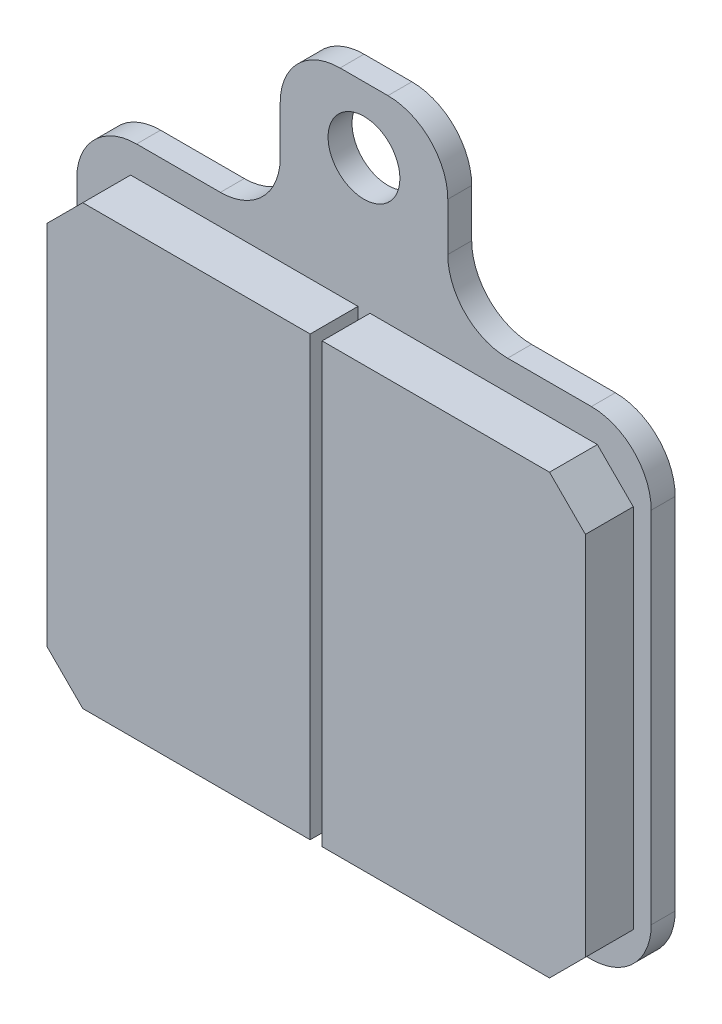
ISO-10303-21;
HEADER;
FILE_DESCRIPTION(('STEP AP214'),'2;1');
FILE_NAME('part.step','',(''),(''),'','','');
FILE_SCHEMA(('AUTOMOTIVE_DESIGN { 1 0 10303 214 1 1 1 1 }'));
ENDSEC;
DATA;
#1=APPLICATION_CONTEXT('core data for automotive mechanical design processes');
#2=APPLICATION_PROTOCOL_DEFINITION('international standard','automotive_design',2000,#1);
#3=PRODUCT_CONTEXT('',#1,'mechanical');
#4=PRODUCT('Part','Part','',(#3));
#5=PRODUCT_RELATED_PRODUCT_CATEGORY('part','',(#4));
#6=PRODUCT_DEFINITION_FORMATION('','',#4);
#7=PRODUCT_DEFINITION_CONTEXT('part definition',#1,'design');
#8=PRODUCT_DEFINITION('design','',#6,#7);
#9=PRODUCT_DEFINITION_SHAPE('','',#8);
#10=(LENGTH_UNIT() NAMED_UNIT(*) SI_UNIT(.MILLI.,.METRE.));
#11=(NAMED_UNIT(*) PLANE_ANGLE_UNIT() SI_UNIT($,.RADIAN.));
#12=(NAMED_UNIT(*) SI_UNIT($,.STERADIAN.) SOLID_ANGLE_UNIT());
#13=UNCERTAINTY_MEASURE_WITH_UNIT(LENGTH_MEASURE(1.E-05),#10,'distance_accuracy_value','');
#14=(GEOMETRIC_REPRESENTATION_CONTEXT(3) GLOBAL_UNCERTAINTY_ASSIGNED_CONTEXT((#13)) GLOBAL_UNIT_ASSIGNED_CONTEXT((#10,
#11,#12)) REPRESENTATION_CONTEXT('',''));
#15=CARTESIAN_POINT('',(0.,0.,0.));
#16=DIRECTION('',(0.,0.,1.));
#17=DIRECTION('',(1.,0.,0.));
#18=AXIS2_PLACEMENT_3D('',#15,#16,#17);
#19=CARTESIAN_POINT('',(2.00000000000001,29.,2.));
#20=DIRECTION('',(0.,0.,1.));
#21=DIRECTION('',(1.,0.,0.));
#22=AXIS2_PLACEMENT_3D('',#19,#20,#21);
#23=PLANE('',#22);
#24=DIRECTION('',(0.,-1.,0.));
#25=VECTOR('',#24,1.);
#26=CARTESIAN_POINT('',(-24.,-20.,2.));
#27=LINE('',#26,#25);
#28=CARTESIAN_POINT('',(-24.,15.,2.));
#29=VERTEX_POINT('',#28);
#30=CARTESIAN_POINT('',(-24.,-15.,2.));
#31=VERTEX_POINT('',#30);
#32=EDGE_CURVE('E300',#29,#31,#27,.T.);
#33=ORIENTED_EDGE('',*,*,#32,.T.);
#34=CARTESIAN_POINT('',(-19.,-15.,2.));
#35=DIRECTION('',(0.,0.,1.));
#36=DIRECTION('',(1.,0.,0.));
#37=AXIS2_PLACEMENT_3D('',#34,#35,#36);
#38=CIRCLE('',#37,5.);
#39=CARTESIAN_POINT('',(-19.,-20.,2.));
#40=VERTEX_POINT('',#39);
#41=EDGE_CURVE('E429',#31,#40,#38,.T.);
#42=ORIENTED_EDGE('',*,*,#41,.T.);
#43=DIRECTION('',(1.,0.,0.));
#44=VECTOR('',#43,1.);
#45=CARTESIAN_POINT('',(24.,-20.,2.));
#46=LINE('',#45,#44);
#47=CARTESIAN_POINT('',(19.,-20.,2.));
#48=VERTEX_POINT('',#47);
#49=EDGE_CURVE('E304',#40,#48,#46,.T.);
#50=ORIENTED_EDGE('',*,*,#49,.T.);
#51=CARTESIAN_POINT('',(19.,-15.,2.));
#52=DIRECTION('',(0.,0.,1.));
#53=DIRECTION('',(1.,0.,0.));
#54=AXIS2_PLACEMENT_3D('',#51,#52,#53);
#55=CIRCLE('',#54,5.);
#56=CARTESIAN_POINT('',(24.,-15.,2.));
#57=VERTEX_POINT('',#56);
#58=EDGE_CURVE('E59',#48,#57,#55,.T.);
#59=ORIENTED_EDGE('',*,*,#58,.T.);
#60=DIRECTION('',(0.,1.,0.));
#61=VECTOR('',#60,1.);
#62=CARTESIAN_POINT('',(24.,-20.,2.));
#63=LINE('',#62,#61);
#64=CARTESIAN_POINT('',(24.,15.,2.));
#65=VERTEX_POINT('',#64);
#66=EDGE_CURVE('E306',#57,#65,#63,.T.);
#67=ORIENTED_EDGE('',*,*,#66,.T.);
#68=CARTESIAN_POINT('',(19.,15.,2.));
#69=DIRECTION('',(0.,0.,1.));
#70=DIRECTION('',(1.,0.,0.));
#71=AXIS2_PLACEMENT_3D('',#68,#69,#70);
#72=CIRCLE('',#71,5.);
#73=CARTESIAN_POINT('',(19.,20.,2.));
#74=VERTEX_POINT('',#73);
#75=EDGE_CURVE('E426',#65,#74,#72,.T.);
#76=ORIENTED_EDGE('',*,*,#75,.T.);
#77=DIRECTION('',(-1.,0.,0.));
#78=VECTOR('',#77,1.);
#79=CARTESIAN_POINT('',(24.,20.,2.));
#80=LINE('',#79,#78);
#81=CARTESIAN_POINT('',(12.,20.,2.));
#82=VERTEX_POINT('',#81);
#83=EDGE_CURVE('E308',#74,#82,#80,.T.);
#84=ORIENTED_EDGE('',*,*,#83,.T.);
#85=CARTESIAN_POINT('',(12.,25.,2.));
#86=DIRECTION('',(0.,0.,1.));
#87=DIRECTION('',(1.,0.,0.));
#88=AXIS2_PLACEMENT_3D('',#85,#86,#87);
#89=CIRCLE('',#88,5.);
#90=CARTESIAN_POINT('',(7.00000000000001,25.,2.));
#91=VERTEX_POINT('',#90);
#92=EDGE_CURVE('E437',#82,#91,#89,.F.);
#93=ORIENTED_EDGE('',*,*,#92,.T.);
#94=DIRECTION('',(0.,1.,0.));
#95=VECTOR('',#94,1.);
#96=CARTESIAN_POINT('',(7.00000000000001,20.,2.));
#97=LINE('',#96,#95);
#98=CARTESIAN_POINT('',(7.00000000000001,29.,2.));
#99=VERTEX_POINT('',#98);
#100=EDGE_CURVE('E311',#91,#99,#97,.T.);
#101=ORIENTED_EDGE('',*,*,#100,.T.);
#102=CARTESIAN_POINT('',(2.00000000000001,29.,2.));
#103=DIRECTION('',(0.,0.,1.));
#104=DIRECTION('',(1.,0.,0.));
#105=AXIS2_PLACEMENT_3D('',#102,#103,#104);
#106=CIRCLE('',#105,5.);
#107=CARTESIAN_POINT('',(1.99999999999997,34.,2.));
#108=VERTEX_POINT('',#107);
#109=EDGE_CURVE('E313',#99,#108,#106,.T.);
#110=ORIENTED_EDGE('',*,*,#109,.T.);
#111=DIRECTION('',(-1.,0.,0.));
#112=VECTOR('',#111,1.);
#113=CARTESIAN_POINT('',(1.99999999999997,34.,2.));
#114=LINE('',#113,#112);
#115=CARTESIAN_POINT('',(-1.99999999999996,34.,2.));
#116=VERTEX_POINT('',#115);
#117=EDGE_CURVE('E315',#108,#116,#114,.T.);
#118=ORIENTED_EDGE('',*,*,#117,.T.);
#119=CARTESIAN_POINT('',(-1.99999999999999,29.,2.));
#120=DIRECTION('',(0.,0.,1.));
#121=DIRECTION('',(1.,0.,0.));
#122=AXIS2_PLACEMENT_3D('',#119,#120,#121);
#123=CIRCLE('',#122,5.);
#124=CARTESIAN_POINT('',(-7.,29.,2.));
#125=VERTEX_POINT('',#124);
#126=EDGE_CURVE('E317',#116,#125,#123,.T.);
#127=ORIENTED_EDGE('',*,*,#126,.T.);
#128=DIRECTION('',(0.,-1.,0.));
#129=VECTOR('',#128,1.);
#130=CARTESIAN_POINT('',(-7.,20.,2.));
#131=LINE('',#130,#129);
#132=CARTESIAN_POINT('',(-6.99999999999999,25.,2.));
#133=VERTEX_POINT('',#132);
#134=EDGE_CURVE('E319',#125,#133,#131,.T.);
#135=ORIENTED_EDGE('',*,*,#134,.T.);
#136=CARTESIAN_POINT('',(-12.,25.,2.));
#137=DIRECTION('',(0.,0.,1.));
#138=DIRECTION('',(1.,0.,0.));
#139=AXIS2_PLACEMENT_3D('',#136,#137,#138);
#140=CIRCLE('',#139,5.);
#141=CARTESIAN_POINT('',(-12.,20.,2.));
#142=VERTEX_POINT('',#141);
#143=EDGE_CURVE('E11',#133,#142,#140,.F.);
#144=ORIENTED_EDGE('',*,*,#143,.T.);
#145=DIRECTION('',(-1.,0.,0.));
#146=VECTOR('',#145,1.);
#147=CARTESIAN_POINT('',(-7.,20.,2.));
#148=LINE('',#147,#146);
#149=CARTESIAN_POINT('',(-19.,20.,2.));
#150=VERTEX_POINT('',#149);
#151=EDGE_CURVE('E297',#142,#150,#148,.T.);
#152=ORIENTED_EDGE('',*,*,#151,.T.);
#153=CARTESIAN_POINT('',(-19.,15.,2.));
#154=DIRECTION('',(0.,0.,1.));
#155=DIRECTION('',(1.,0.,0.));
#156=AXIS2_PLACEMENT_3D('',#153,#154,#155);
#157=CIRCLE('',#156,5.);
#158=EDGE_CURVE('E424',#150,#29,#157,.T.);
#159=ORIENTED_EDGE('',*,*,#158,.T.);
#160=EDGE_LOOP('',(#33,#42,#50,#59,#67,#76,#84,#93,#101,#110,#118,#127,#135,#144,#152,#159));
#161=FACE_BOUND('',#160,.T.);
#162=CARTESIAN_POINT('',(0.,28.5,2.));
#163=DIRECTION('',(0.,0.,1.));
#164=DIRECTION('',(1.,0.,0.));
#165=AXIS2_PLACEMENT_3D('',#162,#163,#164);
#166=CIRCLE('',#165,3.);
#167=CARTESIAN_POINT('',(3.,28.5,2.));
#168=VERTEX_POINT('',#167);
#169=EDGE_CURVE('E291',#168,#168,#166,.T.);
#170=ORIENTED_EDGE('',*,*,#169,.F.);
#171=EDGE_LOOP('',(#170));
#172=FACE_BOUND('',#171,.T.);
#173=DIRECTION('',(0.,-1.,0.));
#174=VECTOR('',#173,1.);
#175=CARTESIAN_POINT('',(-22.5,-17.5,2.));
#176=LINE('',#175,#174);
#177=CARTESIAN_POINT('',(-22.5,14.5,2.));
#178=VERTEX_POINT('',#177);
#179=CARTESIAN_POINT('',(-22.5,-16.1003534196508,2.));
#180=VERTEX_POINT('',#179);
#181=EDGE_CURVE('E279',#178,#180,#176,.T.);
#182=ORIENTED_EDGE('',*,*,#181,.F.);
#183=DIRECTION('',(-0.707106781186549,-0.707106781186546,0.));
#184=VECTOR('',#183,1.);
#185=CARTESIAN_POINT('',(-22.5,14.5,2.));
#186=LINE('',#185,#184);
#187=CARTESIAN_POINT('',(-19.5,17.5,2.));
#188=VERTEX_POINT('',#187);
#189=EDGE_CURVE('E389',#178,#188,#186,.F.);
#190=ORIENTED_EDGE('',*,*,#189,.T.);
#191=DIRECTION('',(-1.,0.,0.));
#192=VECTOR('',#191,1.);
#193=CARTESIAN_POINT('',(-0.5,17.5,2.));
#194=LINE('',#193,#192);
#195=CARTESIAN_POINT('',(-0.5,17.5,2.));
#196=VERTEX_POINT('',#195);
#197=EDGE_CURVE('E245',#196,#188,#194,.T.);
#198=ORIENTED_EDGE('',*,*,#197,.F.);
#199=DIRECTION('',(0.,1.,0.));
#200=VECTOR('',#199,1.);
#201=CARTESIAN_POINT('',(-0.5,-17.5,2.));
#202=LINE('',#201,#200);
#203=CARTESIAN_POINT('',(-0.5,-19.1003534196508,2.));
#204=VERTEX_POINT('',#203);
#205=EDGE_CURVE('E269',#204,#196,#202,.T.);
#206=ORIENTED_EDGE('',*,*,#205,.F.);
#207=DIRECTION('',(1.,0.,0.));
#208=VECTOR('',#207,1.);
#209=CARTESIAN_POINT('',(-22.5,-19.1003534196508,2.));
#210=LINE('',#209,#208);
#211=CARTESIAN_POINT('',(-19.5,-19.1003534196508,2.));
#212=VERTEX_POINT('',#211);
#213=EDGE_CURVE('E282',#212,#204,#210,.T.);
#214=ORIENTED_EDGE('',*,*,#213,.F.);
#215=DIRECTION('',(0.707106781186547,-0.707106781186548,0.));
#216=VECTOR('',#215,1.);
#217=CARTESIAN_POINT('',(-19.5,-19.1003534196508,2.));
#218=LINE('',#217,#216);
#219=EDGE_CURVE('E387',#212,#180,#218,.F.);
#220=ORIENTED_EDGE('',*,*,#219,.T.);
#221=EDGE_LOOP('',(#182,#190,#198,#206,#214,#220));
#222=FACE_BOUND('',#221,.T.);
#223=DIRECTION('',(-1.,0.,0.));
#224=VECTOR('',#223,1.);
#225=CARTESIAN_POINT('',(22.5,17.5,2.));
#226=LINE('',#225,#224);
#227=CARTESIAN_POINT('',(19.5,17.5,2.));
#228=VERTEX_POINT('',#227);
#229=CARTESIAN_POINT('',(0.5,17.5,2.));
#230=VERTEX_POINT('',#229);
#231=EDGE_CURVE('E241',#228,#230,#226,.T.);
#232=ORIENTED_EDGE('',*,*,#231,.F.);
#233=DIRECTION('',(-0.707106781186546,0.707106781186549,0.));
#234=VECTOR('',#233,1.);
#235=CARTESIAN_POINT('',(19.5,17.5,2.));
#236=LINE('',#235,#234);
#237=CARTESIAN_POINT('',(22.5,14.5,2.));
#238=VERTEX_POINT('',#237);
#239=EDGE_CURVE('E385',#228,#238,#236,.F.);
#240=ORIENTED_EDGE('',*,*,#239,.T.);
#241=DIRECTION('',(0.,1.,0.));
#242=VECTOR('',#241,1.);
#243=CARTESIAN_POINT('',(22.5,-17.5,2.));
#244=LINE('',#243,#242);
#245=CARTESIAN_POINT('',(22.5,-16.1003534196508,2.));
#246=VERTEX_POINT('',#245);
#247=EDGE_CURVE('E255',#246,#238,#244,.T.);
#248=ORIENTED_EDGE('',*,*,#247,.F.);
#249=DIRECTION('',(0.707106781186549,0.707106781186546,0.));
#250=VECTOR('',#249,1.);
#251=CARTESIAN_POINT('',(22.5,-16.1003534196508,2.));
#252=LINE('',#251,#250);
#253=CARTESIAN_POINT('',(19.5,-19.1003534196508,2.));
#254=VERTEX_POINT('',#253);
#255=EDGE_CURVE('E383',#246,#254,#252,.F.);
#256=ORIENTED_EDGE('',*,*,#255,.T.);
#257=DIRECTION('',(1.,0.,0.));
#258=VECTOR('',#257,1.);
#259=CARTESIAN_POINT('',(0.499999999999997,-19.1003534196508,2.));
#260=LINE('',#259,#258);
#261=CARTESIAN_POINT('',(0.499999999999997,-19.1003534196508,2.));
#262=VERTEX_POINT('',#261);
#263=EDGE_CURVE('E261',#262,#254,#260,.T.);
#264=ORIENTED_EDGE('',*,*,#263,.F.);
#265=DIRECTION('',(0.,-1.,0.));
#266=VECTOR('',#265,1.);
#267=CARTESIAN_POINT('',(0.5,-17.5,2.));
#268=LINE('',#267,#266);
#269=EDGE_CURVE('E259',#230,#262,#268,.T.);
#270=ORIENTED_EDGE('',*,*,#269,.F.);
#271=EDGE_LOOP('',(#232,#240,#248,#256,#264,#270));
#272=FACE_BOUND('',#271,.T.);
#273=ADVANCED_FACE('F37',(#161,#172,#222,#272),#23,.T.);
#274=CARTESIAN_POINT('',(2.00000000000001,29.,0.));
#275=DIRECTION('',(0.,0.,1.));
#276=DIRECTION('',(1.,0.,0.));
#277=AXIS2_PLACEMENT_3D('',#274,#275,#276);
#278=PLANE('',#277);
#279=DIRECTION('',(1.,0.,0.));
#280=VECTOR('',#279,1.);
#281=CARTESIAN_POINT('',(24.,-20.,0.));
#282=LINE('',#281,#280);
#283=CARTESIAN_POINT('',(-19.,-20.,0.));
#284=VERTEX_POINT('',#283);
#285=CARTESIAN_POINT('',(19.,-20.,0.));
#286=VERTEX_POINT('',#285);
#287=EDGE_CURVE('E328',#284,#286,#282,.T.);
#288=ORIENTED_EDGE('',*,*,#287,.F.);
#289=CARTESIAN_POINT('',(-19.,-15.,0.));
#290=DIRECTION('',(0.,0.,1.));
#291=DIRECTION('',(1.,0.,0.));
#292=AXIS2_PLACEMENT_3D('',#289,#290,#291);
#293=CIRCLE('',#292,5.);
#294=CARTESIAN_POINT('',(-24.,-15.,0.));
#295=VERTEX_POINT('',#294);
#296=EDGE_CURVE('E417',#284,#295,#293,.F.);
#297=ORIENTED_EDGE('',*,*,#296,.T.);
#298=DIRECTION('',(0.,-1.,0.));
#299=VECTOR('',#298,1.);
#300=CARTESIAN_POINT('',(-24.,-20.,0.));
#301=LINE('',#300,#299);
#302=CARTESIAN_POINT('',(-24.,15.,0.));
#303=VERTEX_POINT('',#302);
#304=EDGE_CURVE('E325',#303,#295,#301,.T.);
#305=ORIENTED_EDGE('',*,*,#304,.F.);
#306=CARTESIAN_POINT('',(-19.,15.,0.));
#307=DIRECTION('',(0.,0.,1.));
#308=DIRECTION('',(1.,0.,0.));
#309=AXIS2_PLACEMENT_3D('',#306,#307,#308);
#310=CIRCLE('',#309,5.);
#311=CARTESIAN_POINT('',(-19.,20.,0.));
#312=VERTEX_POINT('',#311);
#313=EDGE_CURVE('E411',#303,#312,#310,.F.);
#314=ORIENTED_EDGE('',*,*,#313,.T.);
#315=DIRECTION('',(-1.,0.,0.));
#316=VECTOR('',#315,1.);
#317=CARTESIAN_POINT('',(-7.,20.,0.));
#318=LINE('',#317,#316);
#319=CARTESIAN_POINT('',(-12.,20.,0.));
#320=VERTEX_POINT('',#319);
#321=EDGE_CURVE('E294',#320,#312,#318,.T.);
#322=ORIENTED_EDGE('',*,*,#321,.F.);
#323=CARTESIAN_POINT('',(-12.,25.,0.));
#324=DIRECTION('',(0.,0.,1.));
#325=DIRECTION('',(1.,0.,0.));
#326=AXIS2_PLACEMENT_3D('',#323,#324,#325);
#327=CIRCLE('',#326,5.);
#328=CARTESIAN_POINT('',(-6.99999999999999,25.,0.));
#329=VERTEX_POINT('',#328);
#330=EDGE_CURVE('E45',#320,#329,#327,.T.);
#331=ORIENTED_EDGE('',*,*,#330,.T.);
#332=DIRECTION('',(0.,-1.,0.));
#333=VECTOR('',#332,1.);
#334=CARTESIAN_POINT('',(-7.,20.,0.));
#335=LINE('',#334,#333);
#336=CARTESIAN_POINT('',(-7.,29.,0.));
#337=VERTEX_POINT('',#336);
#338=EDGE_CURVE('E301',#337,#329,#335,.T.);
#339=ORIENTED_EDGE('',*,*,#338,.F.);
#340=CARTESIAN_POINT('',(-1.99999999999999,29.,0.));
#341=DIRECTION('',(0.,0.,1.));
#342=DIRECTION('',(1.,0.,0.));
#343=AXIS2_PLACEMENT_3D('',#340,#341,#342);
#344=CIRCLE('',#343,5.);
#345=CARTESIAN_POINT('',(-1.99999999999996,34.,0.));
#346=VERTEX_POINT('',#345);
#347=EDGE_CURVE('E342',#346,#337,#344,.T.);
#348=ORIENTED_EDGE('',*,*,#347,.F.);
#349=DIRECTION('',(-1.,0.,0.));
#350=VECTOR('',#349,1.);
#351=CARTESIAN_POINT('',(1.99999999999997,34.,0.));
#352=LINE('',#351,#350);
#353=CARTESIAN_POINT('',(1.99999999999997,34.,0.));
#354=VERTEX_POINT('',#353);
#355=EDGE_CURVE('E340',#354,#346,#352,.T.);
#356=ORIENTED_EDGE('',*,*,#355,.F.);
#357=CARTESIAN_POINT('',(2.00000000000001,29.,0.));
#358=DIRECTION('',(0.,0.,1.));
#359=DIRECTION('',(1.,0.,0.));
#360=AXIS2_PLACEMENT_3D('',#357,#358,#359);
#361=CIRCLE('',#360,5.);
#362=CARTESIAN_POINT('',(7.00000000000001,29.,0.));
#363=VERTEX_POINT('',#362);
#364=EDGE_CURVE('E338',#363,#354,#361,.T.);
#365=ORIENTED_EDGE('',*,*,#364,.F.);
#366=DIRECTION('',(0.,1.,0.));
#367=VECTOR('',#366,1.);
#368=CARTESIAN_POINT('',(7.00000000000001,20.,0.));
#369=LINE('',#368,#367);
#370=CARTESIAN_POINT('',(7.00000000000001,25.,0.));
#371=VERTEX_POINT('',#370);
#372=EDGE_CURVE('E336',#371,#363,#369,.T.);
#373=ORIENTED_EDGE('',*,*,#372,.F.);
#374=CARTESIAN_POINT('',(12.,25.,0.));
#375=DIRECTION('',(0.,0.,1.));
#376=DIRECTION('',(1.,0.,0.));
#377=AXIS2_PLACEMENT_3D('',#374,#375,#376);
#378=CIRCLE('',#377,5.);
#379=CARTESIAN_POINT('',(12.,20.,0.));
#380=VERTEX_POINT('',#379);
#381=EDGE_CURVE('E435',#371,#380,#378,.T.);
#382=ORIENTED_EDGE('',*,*,#381,.T.);
#383=DIRECTION('',(-1.,0.,0.));
#384=VECTOR('',#383,1.);
#385=CARTESIAN_POINT('',(24.,20.,0.));
#386=LINE('',#385,#384);
#387=CARTESIAN_POINT('',(19.,20.,0.));
#388=VERTEX_POINT('',#387);
#389=EDGE_CURVE('E333',#388,#380,#386,.T.);
#390=ORIENTED_EDGE('',*,*,#389,.F.);
#391=CARTESIAN_POINT('',(19.,15.,0.));
#392=DIRECTION('',(0.,0.,1.));
#393=DIRECTION('',(1.,0.,0.));
#394=AXIS2_PLACEMENT_3D('',#391,#392,#393);
#395=CIRCLE('',#394,5.);
#396=CARTESIAN_POINT('',(24.,15.,0.));
#397=VERTEX_POINT('',#396);
#398=EDGE_CURVE('E413',#388,#397,#395,.F.);
#399=ORIENTED_EDGE('',*,*,#398,.T.);
#400=DIRECTION('',(0.,1.,0.));
#401=VECTOR('',#400,1.);
#402=CARTESIAN_POINT('',(24.,-20.,0.));
#403=LINE('',#402,#401);
#404=CARTESIAN_POINT('',(24.,-15.,0.));
#405=VERTEX_POINT('',#404);
#406=EDGE_CURVE('E331',#405,#397,#403,.T.);
#407=ORIENTED_EDGE('',*,*,#406,.F.);
#408=CARTESIAN_POINT('',(19.,-15.,0.));
#409=DIRECTION('',(0.,0.,1.));
#410=DIRECTION('',(1.,0.,0.));
#411=AXIS2_PLACEMENT_3D('',#408,#409,#410);
#412=CIRCLE('',#411,5.);
#413=EDGE_CURVE('E415',#405,#286,#412,.F.);
#414=ORIENTED_EDGE('',*,*,#413,.T.);
#415=EDGE_LOOP('',(#288,#297,#305,#314,#322,#331,#339,#348,#356,#365,#373,#382,#390,#399,#407,#414));
#416=FACE_BOUND('',#415,.T.);
#417=CARTESIAN_POINT('',(0.,28.5,0.));
#418=DIRECTION('',(0.,0.,1.));
#419=DIRECTION('',(1.,0.,0.));
#420=AXIS2_PLACEMENT_3D('',#417,#418,#419);
#421=CIRCLE('',#420,3.);
#422=CARTESIAN_POINT('',(3.,28.5,0.));
#423=VERTEX_POINT('',#422);
#424=EDGE_CURVE('E290',#423,#423,#421,.T.);
#425=ORIENTED_EDGE('',*,*,#424,.T.);
#426=EDGE_LOOP('',(#425));
#427=FACE_BOUND('',#426,.T.);
#428=ADVANCED_FACE('F442',(#416,#427),#278,.F.);
#429=CARTESIAN_POINT('',(-7.,20.,2.));
#430=DIRECTION('',(0.,-1.,0.));
#431=DIRECTION('',(1.,0.,0.));
#432=AXIS2_PLACEMENT_3D('',#429,#430,#431);
#433=PLANE('',#432);
#434=ORIENTED_EDGE('',*,*,#151,.F.);
#435=DIRECTION('',(0.,0.,-1.));
#436=VECTOR('',#435,1.);
#437=CARTESIAN_POINT('',(-12.,20.,0.));
#438=LINE('',#437,#436);
#439=EDGE_CURVE('E401',#142,#320,#438,.T.);
#440=ORIENTED_EDGE('',*,*,#439,.T.);
#441=ORIENTED_EDGE('',*,*,#321,.T.);
#442=DIRECTION('',(0.,0.,-1.));
#443=VECTOR('',#442,1.);
#444=CARTESIAN_POINT('',(-19.,20.,2.));
#445=LINE('',#444,#443);
#446=EDGE_CURVE('E399',#312,#150,#445,.F.);
#447=ORIENTED_EDGE('',*,*,#446,.T.);
#448=EDGE_LOOP('',(#434,#440,#441,#447));
#449=FACE_BOUND('',#448,.T.);
#450=ADVANCED_FACE('F458',(#449),#433,.F.);
#451=CARTESIAN_POINT('',(-24.,-20.,2.));
#452=DIRECTION('',(1.,0.,0.));
#453=DIRECTION('',(0.,0.,-1.));
#454=AXIS2_PLACEMENT_3D('',#451,#452,#453);
#455=PLANE('',#454);
#456=ORIENTED_EDGE('',*,*,#304,.T.);
#457=DIRECTION('',(0.,0.,-1.));
#458=VECTOR('',#457,1.);
#459=CARTESIAN_POINT('',(-24.,-15.,2.));
#460=LINE('',#459,#458);
#461=EDGE_CURVE('E422',#295,#31,#460,.F.);
#462=ORIENTED_EDGE('',*,*,#461,.T.);
#463=ORIENTED_EDGE('',*,*,#32,.F.);
#464=DIRECTION('',(0.,0.,-1.));
#465=VECTOR('',#464,1.);
#466=CARTESIAN_POINT('',(-24.,15.,2.));
#467=LINE('',#466,#465);
#468=EDGE_CURVE('E419',#29,#303,#467,.T.);
#469=ORIENTED_EDGE('',*,*,#468,.T.);
#470=EDGE_LOOP('',(#456,#462,#463,#469));
#471=FACE_BOUND('',#470,.T.);
#472=ADVANCED_FACE('F465',(#471),#455,.F.);
#473=CARTESIAN_POINT('',(24.,-20.,2.));
#474=DIRECTION('',(0.,1.,0.));
#475=DIRECTION('',(-1.,0.,0.));
#476=AXIS2_PLACEMENT_3D('',#473,#474,#475);
#477=PLANE('',#476);
#478=ORIENTED_EDGE('',*,*,#49,.F.);
#479=DIRECTION('',(0.,0.,-1.));
#480=VECTOR('',#479,1.);
#481=CARTESIAN_POINT('',(-19.,-20.,2.));
#482=LINE('',#481,#480);
#483=EDGE_CURVE('E408',#40,#284,#482,.T.);
#484=ORIENTED_EDGE('',*,*,#483,.T.);
#485=ORIENTED_EDGE('',*,*,#287,.T.);
#486=DIRECTION('',(0.,0.,-1.));
#487=VECTOR('',#486,1.);
#488=CARTESIAN_POINT('',(19.,-20.,2.));
#489=LINE('',#488,#487);
#490=EDGE_CURVE('E406',#286,#48,#489,.F.);
#491=ORIENTED_EDGE('',*,*,#490,.T.);
#492=EDGE_LOOP('',(#478,#484,#485,#491));
#493=FACE_BOUND('',#492,.T.);
#494=ADVANCED_FACE('F473',(#493),#477,.F.);
#495=CARTESIAN_POINT('',(24.,-20.,2.));
#496=DIRECTION('',(-1.,0.,0.));
#497=DIRECTION('',(0.,0.,1.));
#498=AXIS2_PLACEMENT_3D('',#495,#496,#497);
#499=PLANE('',#498);
#500=ORIENTED_EDGE('',*,*,#66,.F.);
#501=DIRECTION('',(0.,0.,-1.));
#502=VECTOR('',#501,1.);
#503=CARTESIAN_POINT('',(24.,-15.,2.));
#504=LINE('',#503,#502);
#505=EDGE_CURVE('E432',#57,#405,#504,.T.);
#506=ORIENTED_EDGE('',*,*,#505,.T.);
#507=ORIENTED_EDGE('',*,*,#406,.T.);
#508=DIRECTION('',(0.,0.,-1.));
#509=VECTOR('',#508,1.);
#510=CARTESIAN_POINT('',(24.,15.,2.));
#511=LINE('',#510,#509);
#512=EDGE_CURVE('E52',#397,#65,#511,.F.);
#513=ORIENTED_EDGE('',*,*,#512,.T.);
#514=EDGE_LOOP('',(#500,#506,#507,#513));
#515=FACE_BOUND('',#514,.T.);
#516=ADVANCED_FACE('F479',(#515),#499,.F.);
#517=CARTESIAN_POINT('',(24.,20.,2.));
#518=DIRECTION('',(0.,-1.,0.));
#519=DIRECTION('',(1.,0.,0.));
#520=AXIS2_PLACEMENT_3D('',#517,#518,#519);
#521=PLANE('',#520);
#522=ORIENTED_EDGE('',*,*,#389,.T.);
#523=DIRECTION('',(0.,0.,-1.));
#524=VECTOR('',#523,1.);
#525=CARTESIAN_POINT('',(12.,20.,2.));
#526=LINE('',#525,#524);
#527=EDGE_CURVE('E397',#380,#82,#526,.F.);
#528=ORIENTED_EDGE('',*,*,#527,.T.);
#529=ORIENTED_EDGE('',*,*,#83,.F.);
#530=DIRECTION('',(0.,0.,-1.));
#531=VECTOR('',#530,1.);
#532=CARTESIAN_POINT('',(19.,20.,2.));
#533=LINE('',#532,#531);
#534=EDGE_CURVE('E394',#74,#388,#533,.T.);
#535=ORIENTED_EDGE('',*,*,#534,.T.);
#536=EDGE_LOOP('',(#522,#528,#529,#535));
#537=FACE_BOUND('',#536,.T.);
#538=ADVANCED_FACE('F487',(#537),#521,.F.);
#539=CARTESIAN_POINT('',(7.00000000000001,20.,2.));
#540=DIRECTION('',(-1.,0.,0.));
#541=DIRECTION('',(0.,-1.,0.));
#542=AXIS2_PLACEMENT_3D('',#539,#540,#541);
#543=PLANE('',#542);
#544=ORIENTED_EDGE('',*,*,#100,.F.);
#545=DIRECTION('',(0.,0.,-1.));
#546=VECTOR('',#545,1.);
#547=CARTESIAN_POINT('',(7.00000000000001,25.,0.));
#548=LINE('',#547,#546);
#549=EDGE_CURVE('E391',#91,#371,#548,.T.);
#550=ORIENTED_EDGE('',*,*,#549,.T.);
#551=ORIENTED_EDGE('',*,*,#372,.T.);
#552=DIRECTION('',(0.,0.,-1.));
#553=VECTOR('',#552,1.);
#554=CARTESIAN_POINT('',(7.00000000000001,29.,2.));
#555=LINE('',#554,#553);
#556=EDGE_CURVE('E354',#99,#363,#555,.T.);
#557=ORIENTED_EDGE('',*,*,#556,.F.);
#558=EDGE_LOOP('',(#544,#550,#551,#557));
#559=FACE_BOUND('',#558,.T.);
#560=ADVANCED_FACE('F496',(#559),#543,.F.);
#561=CARTESIAN_POINT('',(2.00000000000001,29.,2.));
#562=DIRECTION('',(0.,0.,-1.));
#563=DIRECTION('',(-1.,0.,0.));
#564=AXIS2_PLACEMENT_3D('',#561,#562,#563);
#565=CYLINDRICAL_SURFACE('',#564,5.);
#566=ORIENTED_EDGE('',*,*,#364,.T.);
#567=DIRECTION('',(0.,0.,-1.));
#568=VECTOR('',#567,1.);
#569=CARTESIAN_POINT('',(1.99999999999997,34.,2.));
#570=LINE('',#569,#568);
#571=EDGE_CURVE('E351',#108,#354,#570,.T.);
#572=ORIENTED_EDGE('',*,*,#571,.F.);
#573=ORIENTED_EDGE('',*,*,#109,.F.);
#574=ORIENTED_EDGE('',*,*,#556,.T.);
#575=EDGE_LOOP('',(#566,#572,#573,#574));
#576=FACE_BOUND('',#575,.T.);
#577=ADVANCED_FACE('F502',(#576),#565,.T.);
#578=CARTESIAN_POINT('',(1.99999999999997,34.,2.));
#579=DIRECTION('',(0.,-1.,0.));
#580=DIRECTION('',(0.,0.,-1.));
#581=AXIS2_PLACEMENT_3D('',#578,#579,#580);
#582=PLANE('',#581);
#583=ORIENTED_EDGE('',*,*,#355,.T.);
#584=DIRECTION('',(0.,0.,-1.));
#585=VECTOR('',#584,1.);
#586=CARTESIAN_POINT('',(-1.99999999999996,34.,2.));
#587=LINE('',#586,#585);
#588=EDGE_CURVE('E348',#116,#346,#587,.T.);
#589=ORIENTED_EDGE('',*,*,#588,.F.);
#590=ORIENTED_EDGE('',*,*,#117,.F.);
#591=ORIENTED_EDGE('',*,*,#571,.T.);
#592=EDGE_LOOP('',(#583,#589,#590,#591));
#593=FACE_BOUND('',#592,.T.);
#594=ADVANCED_FACE('F506',(#593),#582,.F.);
#595=CARTESIAN_POINT('',(-1.99999999999999,29.,2.));
#596=DIRECTION('',(0.,0.,-1.));
#597=DIRECTION('',(-1.,0.,0.));
#598=AXIS2_PLACEMENT_3D('',#595,#596,#597);
#599=CYLINDRICAL_SURFACE('',#598,5.);
#600=ORIENTED_EDGE('',*,*,#347,.T.);
#601=DIRECTION('',(0.,0.,-1.));
#602=VECTOR('',#601,1.);
#603=CARTESIAN_POINT('',(-7.,29.,2.));
#604=LINE('',#603,#602);
#605=EDGE_CURVE('E322',#125,#337,#604,.T.);
#606=ORIENTED_EDGE('',*,*,#605,.F.);
#607=ORIENTED_EDGE('',*,*,#126,.F.);
#608=ORIENTED_EDGE('',*,*,#588,.T.);
#609=EDGE_LOOP('',(#600,#606,#607,#608));
#610=FACE_BOUND('',#609,.T.);
#611=ADVANCED_FACE('F510',(#610),#599,.T.);
#612=CARTESIAN_POINT('',(-7.,20.,2.));
#613=DIRECTION('',(1.,0.,0.));
#614=DIRECTION('',(0.,1.,0.));
#615=AXIS2_PLACEMENT_3D('',#612,#613,#614);
#616=PLANE('',#615);
#617=ORIENTED_EDGE('',*,*,#338,.T.);
#618=DIRECTION('',(0.,0.,-1.));
#619=VECTOR('',#618,1.);
#620=CARTESIAN_POINT('',(-6.99999999999999,25.,2.));
#621=LINE('',#620,#619);
#622=EDGE_CURVE('E404',#329,#133,#621,.F.);
#623=ORIENTED_EDGE('',*,*,#622,.T.);
#624=ORIENTED_EDGE('',*,*,#134,.F.);
#625=ORIENTED_EDGE('',*,*,#605,.T.);
#626=EDGE_LOOP('',(#617,#623,#624,#625));
#627=FACE_BOUND('',#626,.T.);
#628=ADVANCED_FACE('F449',(#627),#616,.F.);
#629=CARTESIAN_POINT('',(0.,28.5,2.));
#630=DIRECTION('',(0.,0.,-1.));
#631=DIRECTION('',(-1.,0.,0.));
#632=AXIS2_PLACEMENT_3D('',#629,#630,#631);
#633=CYLINDRICAL_SURFACE('',#632,3.);
#634=ORIENTED_EDGE('',*,*,#169,.T.);
#635=EDGE_LOOP('',(#634));
#636=FACE_BOUND('',#635,.T.);
#637=ORIENTED_EDGE('',*,*,#424,.F.);
#638=EDGE_LOOP('',(#637));
#639=FACE_BOUND('',#638,.T.);
#640=ADVANCED_FACE('F517',(#636,#639),#633,.F.);
#641=CARTESIAN_POINT('',(-0.5,17.5,6.));
#642=DIRECTION('',(0.,-1.,0.));
#643=DIRECTION('',(1.,0.,0.));
#644=AXIS2_PLACEMENT_3D('',#641,#642,#643);
#645=PLANE('',#644);
#646=ORIENTED_EDGE('',*,*,#197,.T.);
#647=DIRECTION('',(0.,0.,1.));
#648=VECTOR('',#647,1.);
#649=CARTESIAN_POINT('',(-19.5,17.5,6.));
#650=LINE('',#649,#648);
#651=CARTESIAN_POINT('',(-19.5,17.5,6.));
#652=VERTEX_POINT('',#651);
#653=EDGE_CURVE('E381',#188,#652,#650,.T.);
#654=ORIENTED_EDGE('',*,*,#653,.T.);
#655=DIRECTION('',(-1.,0.,0.));
#656=VECTOR('',#655,1.);
#657=CARTESIAN_POINT('',(-0.5,17.5,6.));
#658=LINE('',#657,#656);
#659=CARTESIAN_POINT('',(-0.5,17.5,6.));
#660=VERTEX_POINT('',#659);
#661=EDGE_CURVE('E265',#660,#652,#658,.T.);
#662=ORIENTED_EDGE('',*,*,#661,.F.);
#663=DIRECTION('',(0.,0.,-1.));
#664=VECTOR('',#663,1.);
#665=CARTESIAN_POINT('',(-0.5,17.5,6.));
#666=LINE('',#665,#664);
#667=EDGE_CURVE('E276',#660,#196,#666,.T.);
#668=ORIENTED_EDGE('',*,*,#667,.T.);
#669=EDGE_LOOP('',(#646,#654,#662,#668));
#670=FACE_BOUND('',#669,.T.);
#671=ADVANCED_FACE('F529',(#670),#645,.F.);
#672=CARTESIAN_POINT('',(-22.5,-17.5,6.));
#673=DIRECTION('',(1.,0.,0.));
#674=DIRECTION('',(0.,0.,-1.));
#675=AXIS2_PLACEMENT_3D('',#672,#673,#674);
#676=PLANE('',#675);
#677=ORIENTED_EDGE('',*,*,#181,.T.);
#678=DIRECTION('',(0.,0.,1.));
#679=VECTOR('',#678,1.);
#680=CARTESIAN_POINT('',(-22.5,-16.1003534196508,6.));
#681=LINE('',#680,#679);
#682=CARTESIAN_POINT('',(-22.5,-16.1003534196508,6.));
#683=VERTEX_POINT('',#682);
#684=EDGE_CURVE('E375',#180,#683,#681,.T.);
#685=ORIENTED_EDGE('',*,*,#684,.T.);
#686=DIRECTION('',(0.,-1.,0.));
#687=VECTOR('',#686,1.);
#688=CARTESIAN_POINT('',(-22.5,-17.5,6.));
#689=LINE('',#688,#687);
#690=CARTESIAN_POINT('',(-22.5,14.5,6.));
#691=VERTEX_POINT('',#690);
#692=EDGE_CURVE('E268',#691,#683,#689,.T.);
#693=ORIENTED_EDGE('',*,*,#692,.F.);
#694=DIRECTION('',(0.,0.,-1.));
#695=VECTOR('',#694,1.);
#696=CARTESIAN_POINT('',(-22.5,14.5,6.));
#697=LINE('',#696,#695);
#698=EDGE_CURVE('E372',#691,#178,#697,.T.);
#699=ORIENTED_EDGE('',*,*,#698,.T.);
#700=EDGE_LOOP('',(#677,#685,#693,#699));
#701=FACE_BOUND('',#700,.T.);
#702=ADVANCED_FACE('F533',(#701),#676,.F.);
#703=CARTESIAN_POINT('',(-22.5,-19.1003534196508,6.));
#704=DIRECTION('',(0.,1.,0.));
#705=DIRECTION('',(0.,0.,1.));
#706=AXIS2_PLACEMENT_3D('',#703,#704,#705);
#707=PLANE('',#706);
#708=DIRECTION('',(1.,0.,0.));
#709=VECTOR('',#708,1.);
#710=CARTESIAN_POINT('',(-22.5,-19.1003534196508,6.));
#711=LINE('',#710,#709);
#712=CARTESIAN_POINT('',(-19.5,-19.1003534196508,6.));
#713=VERTEX_POINT('',#712);
#714=CARTESIAN_POINT('',(-0.500000000000004,-19.1003534196508,6.));
#715=VERTEX_POINT('',#714);
#716=EDGE_CURVE('E272',#713,#715,#711,.T.);
#717=ORIENTED_EDGE('',*,*,#716,.F.);
#718=DIRECTION('',(0.,0.,-1.));
#719=VECTOR('',#718,1.);
#720=CARTESIAN_POINT('',(-19.5,-19.1003534196508,6.));
#721=LINE('',#720,#719);
#722=EDGE_CURVE('E369',#713,#212,#721,.T.);
#723=ORIENTED_EDGE('',*,*,#722,.T.);
#724=ORIENTED_EDGE('',*,*,#213,.T.);
#725=DIRECTION('',(0.,0.,-1.));
#726=VECTOR('',#725,1.);
#727=CARTESIAN_POINT('',(-0.500000000000004,-19.1003534196508,6.));
#728=LINE('',#727,#726);
#729=EDGE_CURVE('E287',#715,#204,#728,.T.);
#730=ORIENTED_EDGE('',*,*,#729,.F.);
#731=EDGE_LOOP('',(#717,#723,#724,#730));
#732=FACE_BOUND('',#731,.T.);
#733=ADVANCED_FACE('F537',(#732),#707,.F.);
#734=CARTESIAN_POINT('',(-0.5,-17.5,6.));
#735=DIRECTION('',(-1.,0.,0.));
#736=DIRECTION('',(0.,0.,1.));
#737=AXIS2_PLACEMENT_3D('',#734,#735,#736);
#738=PLANE('',#737);
#739=ORIENTED_EDGE('',*,*,#205,.T.);
#740=ORIENTED_EDGE('',*,*,#667,.F.);
#741=DIRECTION('',(0.,1.,0.));
#742=VECTOR('',#741,1.);
#743=CARTESIAN_POINT('',(-0.5,-17.5,6.));
#744=LINE('',#743,#742);
#745=EDGE_CURVE('E274',#715,#660,#744,.T.);
#746=ORIENTED_EDGE('',*,*,#745,.F.);
#747=ORIENTED_EDGE('',*,*,#729,.T.);
#748=EDGE_LOOP('',(#739,#740,#746,#747));
#749=FACE_BOUND('',#748,.T.);
#750=ADVANCED_FACE('F541',(#749),#738,.F.);
#751=CARTESIAN_POINT('',(0.,0.,6.));
#752=DIRECTION('',(0.,0.,-1.));
#753=DIRECTION('',(-1.,0.,0.));
#754=AXIS2_PLACEMENT_3D('',#751,#752,#753);
#755=PLANE('',#754);
#756=ORIENTED_EDGE('',*,*,#692,.T.);
#757=DIRECTION('',(-0.707106781186547,0.707106781186548,0.));
#758=VECTOR('',#757,1.);
#759=CARTESIAN_POINT('',(-19.5,-19.1003534196508,6.));
#760=LINE('',#759,#758);
#761=EDGE_CURVE('E379',#683,#713,#760,.F.);
#762=ORIENTED_EDGE('',*,*,#761,.T.);
#763=ORIENTED_EDGE('',*,*,#716,.T.);
#764=ORIENTED_EDGE('',*,*,#745,.T.);
#765=ORIENTED_EDGE('',*,*,#661,.T.);
#766=DIRECTION('',(0.707106781186549,0.707106781186546,0.));
#767=VECTOR('',#766,1.);
#768=CARTESIAN_POINT('',(-22.5,14.5,6.));
#769=LINE('',#768,#767);
#770=EDGE_CURVE('E377',#652,#691,#769,.F.);
#771=ORIENTED_EDGE('',*,*,#770,.T.);
#772=EDGE_LOOP('',(#756,#762,#763,#764,#765,#771));
#773=FACE_BOUND('',#772,.T.);
#774=ADVANCED_FACE('F545',(#773),#755,.F.);
#775=CARTESIAN_POINT('',(22.5,-17.5,6.));
#776=DIRECTION('',(-1.,0.,0.));
#777=DIRECTION('',(0.,0.,1.));
#778=AXIS2_PLACEMENT_3D('',#775,#776,#777);
#779=PLANE('',#778);
#780=DIRECTION('',(0.,1.,0.));
#781=VECTOR('',#780,1.);
#782=CARTESIAN_POINT('',(22.5,-19.1003534196508,6.));
#783=LINE('',#782,#781);
#784=CARTESIAN_POINT('',(22.5,-16.1003534196508,6.));
#785=VERTEX_POINT('',#784);
#786=CARTESIAN_POINT('',(22.5,14.5,6.));
#787=VERTEX_POINT('',#786);
#788=EDGE_CURVE('E235',#785,#787,#783,.T.);
#789=ORIENTED_EDGE('',*,*,#788,.F.);
#790=DIRECTION('',(0.,0.,-1.));
#791=VECTOR('',#790,1.);
#792=CARTESIAN_POINT('',(22.5,-16.1003534196508,6.));
#793=LINE('',#792,#791);
#794=EDGE_CURVE('E359',#785,#246,#793,.T.);
#795=ORIENTED_EDGE('',*,*,#794,.T.);
#796=ORIENTED_EDGE('',*,*,#247,.T.);
#797=DIRECTION('',(0.,0.,1.));
#798=VECTOR('',#797,1.);
#799=CARTESIAN_POINT('',(22.5,14.5,6.));
#800=LINE('',#799,#798);
#801=EDGE_CURVE('E357',#238,#787,#800,.T.);
#802=ORIENTED_EDGE('',*,*,#801,.T.);
#803=EDGE_LOOP('',(#789,#795,#796,#802));
#804=FACE_BOUND('',#803,.T.);
#805=ADVANCED_FACE('F549',(#804),#779,.F.);
#806=CARTESIAN_POINT('',(22.5,17.5,6.));
#807=DIRECTION('',(0.,-1.,0.));
#808=DIRECTION('',(0.,0.,-1.));
#809=AXIS2_PLACEMENT_3D('',#806,#807,#808);
#810=PLANE('',#809);
#811=DIRECTION('',(-1.,0.,0.));
#812=VECTOR('',#811,1.);
#813=CARTESIAN_POINT('',(22.5,17.5,6.));
#814=LINE('',#813,#812);
#815=CARTESIAN_POINT('',(19.5,17.5,6.));
#816=VERTEX_POINT('',#815);
#817=CARTESIAN_POINT('',(0.5,17.5,6.));
#818=VERTEX_POINT('',#817);
#819=EDGE_CURVE('E222',#816,#818,#814,.T.);
#820=ORIENTED_EDGE('',*,*,#819,.F.);
#821=DIRECTION('',(0.,0.,-1.));
#822=VECTOR('',#821,1.);
#823=CARTESIAN_POINT('',(19.5,17.5,6.));
#824=LINE('',#823,#822);
#825=EDGE_CURVE('E367',#816,#228,#824,.T.);
#826=ORIENTED_EDGE('',*,*,#825,.T.);
#827=ORIENTED_EDGE('',*,*,#231,.T.);
#828=DIRECTION('',(0.,0.,-1.));
#829=VECTOR('',#828,1.);
#830=CARTESIAN_POINT('',(0.5,17.5,6.));
#831=LINE('',#830,#829);
#832=EDGE_CURVE('E238',#818,#230,#831,.T.);
#833=ORIENTED_EDGE('',*,*,#832,.F.);
#834=EDGE_LOOP('',(#820,#826,#827,#833));
#835=FACE_BOUND('',#834,.T.);
#836=ADVANCED_FACE('F239',(#835),#810,.F.);
#837=CARTESIAN_POINT('',(0.5,-17.5,6.));
#838=DIRECTION('',(1.,0.,0.));
#839=DIRECTION('',(0.,1.,0.));
#840=AXIS2_PLACEMENT_3D('',#837,#838,#839);
#841=PLANE('',#840);
#842=ORIENTED_EDGE('',*,*,#269,.T.);
#843=DIRECTION('',(0.,0.,-1.));
#844=VECTOR('',#843,1.);
#845=CARTESIAN_POINT('',(0.499999999999997,-19.1003534196508,6.));
#846=LINE('',#845,#844);
#847=CARTESIAN_POINT('',(0.499999999999997,-19.1003534196508,6.));
#848=VERTEX_POINT('',#847);
#849=EDGE_CURVE('E246',#848,#262,#846,.T.);
#850=ORIENTED_EDGE('',*,*,#849,.F.);
#851=DIRECTION('',(0.,-1.,0.));
#852=VECTOR('',#851,1.);
#853=CARTESIAN_POINT('',(0.5,-17.5,6.));
#854=LINE('',#853,#852);
#855=EDGE_CURVE('E227',#818,#848,#854,.T.);
#856=ORIENTED_EDGE('',*,*,#855,.F.);
#857=ORIENTED_EDGE('',*,*,#832,.T.);
#858=EDGE_LOOP('',(#842,#850,#856,#857));
#859=FACE_BOUND('',#858,.T.);
#860=ADVANCED_FACE('F248',(#859),#841,.F.);
#861=CARTESIAN_POINT('',(0.499999999999997,-19.1003534196508,6.));
#862=DIRECTION('',(0.,1.,0.));
#863=DIRECTION('',(0.,0.,1.));
#864=AXIS2_PLACEMENT_3D('',#861,#862,#863);
#865=PLANE('',#864);
#866=ORIENTED_EDGE('',*,*,#263,.T.);
#867=DIRECTION('',(0.,0.,1.));
#868=VECTOR('',#867,1.);
#869=CARTESIAN_POINT('',(19.5,-19.1003534196508,6.));
#870=LINE('',#869,#868);
#871=CARTESIAN_POINT('',(19.5,-19.1003534196508,6.));
#872=VERTEX_POINT('',#871);
#873=EDGE_CURVE('E362',#254,#872,#870,.T.);
#874=ORIENTED_EDGE('',*,*,#873,.T.);
#875=DIRECTION('',(1.,0.,0.));
#876=VECTOR('',#875,1.);
#877=CARTESIAN_POINT('',(0.499999999999997,-19.1003534196508,6.));
#878=LINE('',#877,#876);
#879=EDGE_CURVE('E250',#848,#872,#878,.T.);
#880=ORIENTED_EDGE('',*,*,#879,.F.);
#881=ORIENTED_EDGE('',*,*,#849,.T.);
#882=EDGE_LOOP('',(#866,#874,#880,#881));
#883=FACE_BOUND('',#882,.T.);
#884=ADVANCED_FACE('F558',(#883),#865,.F.);
#885=CARTESIAN_POINT('',(0.,0.,6.));
#886=DIRECTION('',(0.,0.,1.));
#887=DIRECTION('',(1.,0.,0.));
#888=AXIS2_PLACEMENT_3D('',#885,#886,#887);
#889=PLANE('',#888);
#890=ORIENTED_EDGE('',*,*,#879,.T.);
#891=DIRECTION('',(-0.707106781186549,-0.707106781186546,0.));
#892=VECTOR('',#891,1.);
#893=CARTESIAN_POINT('',(19.3001767098253,-19.3001767098254,6.));
#894=LINE('',#893,#892);
#895=EDGE_CURVE('E365',#872,#785,#894,.F.);
#896=ORIENTED_EDGE('',*,*,#895,.T.);
#897=ORIENTED_EDGE('',*,*,#788,.T.);
#898=DIRECTION('',(0.707106781186546,-0.707106781186549,0.));
#899=VECTOR('',#898,1.);
#900=CARTESIAN_POINT('',(18.5,18.5,6.));
#901=LINE('',#900,#899);
#902=EDGE_CURVE('E231',#787,#816,#901,.F.);
#903=ORIENTED_EDGE('',*,*,#902,.T.);
#904=ORIENTED_EDGE('',*,*,#819,.T.);
#905=ORIENTED_EDGE('',*,*,#855,.T.);
#906=EDGE_LOOP('',(#890,#896,#897,#903,#904,#905));
#907=FACE_BOUND('',#906,.T.);
#908=ADVANCED_FACE('F225',(#907),#889,.T.);
#909=CARTESIAN_POINT('',(22.5,-16.1003534196508,6.));
#910=DIRECTION('',(-0.707106781186546,0.707106781186549,0.));
#911=DIRECTION('',(0.,0.,-1.));
#912=AXIS2_PLACEMENT_3D('',#909,#910,#911);
#913=PLANE('',#912);
#914=ORIENTED_EDGE('',*,*,#895,.F.);
#915=ORIENTED_EDGE('',*,*,#873,.F.);
#916=ORIENTED_EDGE('',*,*,#255,.F.);
#917=ORIENTED_EDGE('',*,*,#794,.F.);
#918=EDGE_LOOP('',(#914,#915,#916,#917));
#919=FACE_BOUND('',#918,.T.);
#920=ADVANCED_FACE('F563',(#919),#913,.F.);
#921=CARTESIAN_POINT('',(19.5,17.5,6.));
#922=DIRECTION('',(-0.707106781186549,-0.707106781186546,0.));
#923=DIRECTION('',(0.,0.,-1.));
#924=AXIS2_PLACEMENT_3D('',#921,#922,#923);
#925=PLANE('',#924);
#926=ORIENTED_EDGE('',*,*,#902,.F.);
#927=ORIENTED_EDGE('',*,*,#801,.F.);
#928=ORIENTED_EDGE('',*,*,#239,.F.);
#929=ORIENTED_EDGE('',*,*,#825,.F.);
#930=EDGE_LOOP('',(#926,#927,#928,#929));
#931=FACE_BOUND('',#930,.T.);
#932=ADVANCED_FACE('F567',(#931),#925,.F.);
#933=CARTESIAN_POINT('',(-19.5,-19.1003534196508,6.));
#934=DIRECTION('',(0.707106781186548,0.707106781186547,0.));
#935=DIRECTION('',(0.,0.,-1.));
#936=AXIS2_PLACEMENT_3D('',#933,#934,#935);
#937=PLANE('',#936);
#938=ORIENTED_EDGE('',*,*,#761,.F.);
#939=ORIENTED_EDGE('',*,*,#684,.F.);
#940=ORIENTED_EDGE('',*,*,#219,.F.);
#941=ORIENTED_EDGE('',*,*,#722,.F.);
#942=EDGE_LOOP('',(#938,#939,#940,#941));
#943=FACE_BOUND('',#942,.T.);
#944=ADVANCED_FACE('F573',(#943),#937,.F.);
#945=CARTESIAN_POINT('',(-22.5,14.5,6.));
#946=DIRECTION('',(0.707106781186546,-0.707106781186549,0.));
#947=DIRECTION('',(0.,0.,-1.));
#948=AXIS2_PLACEMENT_3D('',#945,#946,#947);
#949=PLANE('',#948);
#950=ORIENTED_EDGE('',*,*,#770,.F.);
#951=ORIENTED_EDGE('',*,*,#653,.F.);
#952=ORIENTED_EDGE('',*,*,#189,.F.);
#953=ORIENTED_EDGE('',*,*,#698,.F.);
#954=EDGE_LOOP('',(#950,#951,#952,#953));
#955=FACE_BOUND('',#954,.T.);
#956=ADVANCED_FACE('F582',(#955),#949,.F.);
#957=CARTESIAN_POINT('',(12.,25.,2.));
#958=DIRECTION('',(0.,0.,1.));
#959=DIRECTION('',(1.,0.,0.));
#960=AXIS2_PLACEMENT_3D('',#957,#958,#959);
#961=CYLINDRICAL_SURFACE('',#960,5.);
#962=ORIENTED_EDGE('',*,*,#92,.F.);
#963=ORIENTED_EDGE('',*,*,#527,.F.);
#964=ORIENTED_EDGE('',*,*,#381,.F.);
#965=ORIENTED_EDGE('',*,*,#549,.F.);
#966=EDGE_LOOP('',(#962,#963,#964,#965));
#967=FACE_BOUND('',#966,.T.);
#968=ADVANCED_FACE('F493',(#967),#961,.F.);
#969=CARTESIAN_POINT('',(-12.,25.,2.));
#970=DIRECTION('',(0.,0.,1.));
#971=DIRECTION('',(1.,0.,0.));
#972=AXIS2_PLACEMENT_3D('',#969,#970,#971);
#973=CYLINDRICAL_SURFACE('',#972,5.);
#974=ORIENTED_EDGE('',*,*,#143,.F.);
#975=ORIENTED_EDGE('',*,*,#622,.F.);
#976=ORIENTED_EDGE('',*,*,#330,.F.);
#977=ORIENTED_EDGE('',*,*,#439,.F.);
#978=EDGE_LOOP('',(#974,#975,#976,#977));
#979=FACE_BOUND('',#978,.T.);
#980=ADVANCED_FACE('F453',(#979),#973,.F.);
#981=CARTESIAN_POINT('',(-19.,-15.,2.));
#982=DIRECTION('',(0.,0.,-1.));
#983=DIRECTION('',(-1.,0.,0.));
#984=AXIS2_PLACEMENT_3D('',#981,#982,#983);
#985=CYLINDRICAL_SURFACE('',#984,5.);
#986=ORIENTED_EDGE('',*,*,#41,.F.);
#987=ORIENTED_EDGE('',*,*,#461,.F.);
#988=ORIENTED_EDGE('',*,*,#296,.F.);
#989=ORIENTED_EDGE('',*,*,#483,.F.);
#990=EDGE_LOOP('',(#986,#987,#988,#989));
#991=FACE_BOUND('',#990,.T.);
#992=ADVANCED_FACE('F469',(#991),#985,.T.);
#993=CARTESIAN_POINT('',(19.,-15.,2.));
#994=DIRECTION('',(0.,0.,-1.));
#995=DIRECTION('',(-1.,0.,0.));
#996=AXIS2_PLACEMENT_3D('',#993,#994,#995);
#997=CYLINDRICAL_SURFACE('',#996,5.);
#998=ORIENTED_EDGE('',*,*,#58,.F.);
#999=ORIENTED_EDGE('',*,*,#490,.F.);
#1000=ORIENTED_EDGE('',*,*,#413,.F.);
#1001=ORIENTED_EDGE('',*,*,#505,.F.);
#1002=EDGE_LOOP('',(#998,#999,#1000,#1001));
#1003=FACE_BOUND('',#1002,.T.);
#1004=ADVANCED_FACE('F476',(#1003),#997,.T.);
#1005=CARTESIAN_POINT('',(19.,15.,2.));
#1006=DIRECTION('',(0.,0.,-1.));
#1007=DIRECTION('',(-1.,0.,0.));
#1008=AXIS2_PLACEMENT_3D('',#1005,#1006,#1007);
#1009=CYLINDRICAL_SURFACE('',#1008,5.);
#1010=ORIENTED_EDGE('',*,*,#75,.F.);
#1011=ORIENTED_EDGE('',*,*,#512,.F.);
#1012=ORIENTED_EDGE('',*,*,#398,.F.);
#1013=ORIENTED_EDGE('',*,*,#534,.F.);
#1014=EDGE_LOOP('',(#1010,#1011,#1012,#1013));
#1015=FACE_BOUND('',#1014,.T.);
#1016=ADVANCED_FACE('F484',(#1015),#1009,.T.);
#1017=CARTESIAN_POINT('',(-19.,15.,2.));
#1018=DIRECTION('',(0.,0.,-1.));
#1019=DIRECTION('',(-1.,0.,0.));
#1020=AXIS2_PLACEMENT_3D('',#1017,#1018,#1019);
#1021=CYLINDRICAL_SURFACE('',#1020,5.);
#1022=ORIENTED_EDGE('',*,*,#158,.F.);
#1023=ORIENTED_EDGE('',*,*,#446,.F.);
#1024=ORIENTED_EDGE('',*,*,#313,.F.);
#1025=ORIENTED_EDGE('',*,*,#468,.F.);
#1026=EDGE_LOOP('',(#1022,#1023,#1024,#1025));
#1027=FACE_BOUND('',#1026,.T.);
#1028=ADVANCED_FACE('F39',(#1027),#1021,.T.);
#1029=CLOSED_SHELL('',(#273,#428,#450,#472,#494,#516,#538,#560,#577,#594,#611,#628,#640,#671,
#702,#733,#750,#774,#805,#836,#860,#884,#908,#920,#932,#944,#956,#968,#980,#992,#1004,#1016,#1028));
#1030=MANIFOLD_SOLID_BREP('B2',#1029);
#1031=ADVANCED_BREP_SHAPE_REPRESENTATION('',(#18,#1030),#14);
#1032=SHAPE_DEFINITION_REPRESENTATION(#9,#1031);
ENDSEC;
END-ISO-10303-21;
